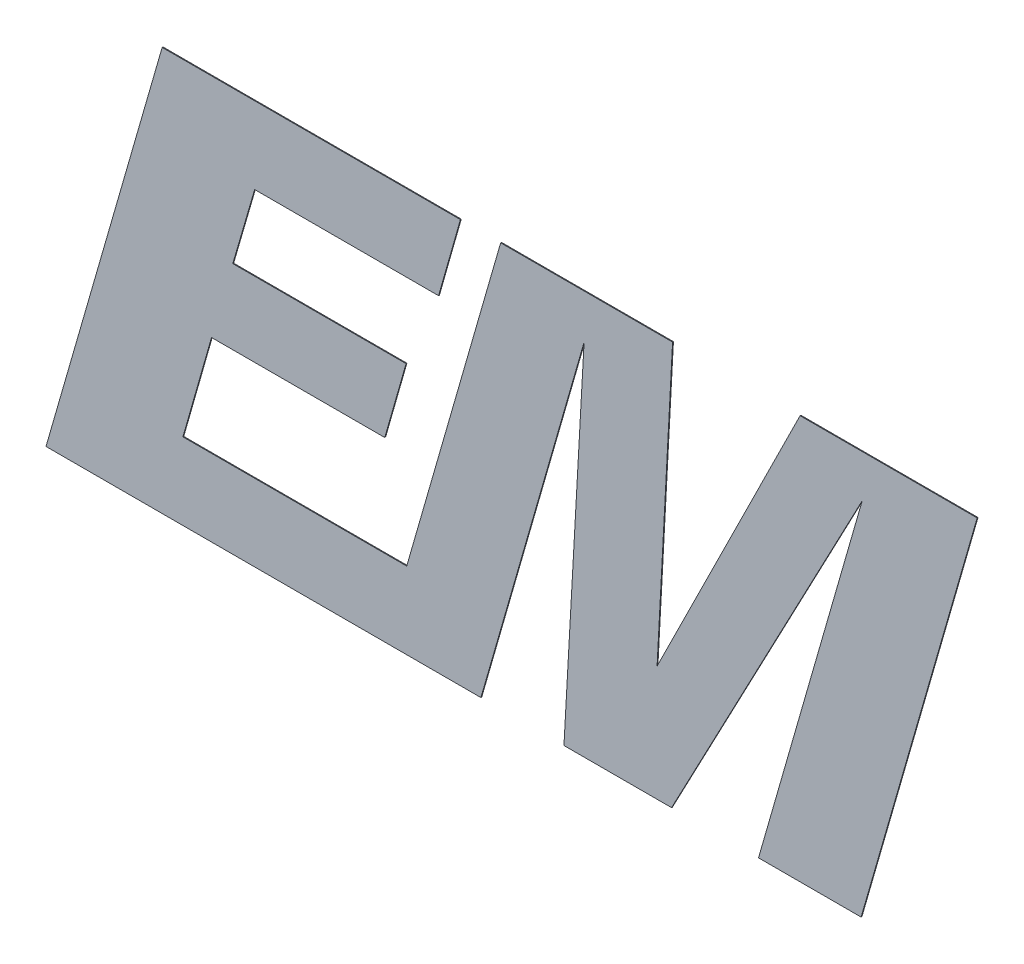
ISO-10303-21;
HEADER;
FILE_DESCRIPTION(('STEP AP214'),'2;1');
FILE_NAME('part.step','',(''),(''),'','','');
FILE_SCHEMA(('AUTOMOTIVE_DESIGN { 1 0 10303 214 1 1 1 1 }'));
ENDSEC;
DATA;
#1=APPLICATION_CONTEXT('core data for automotive mechanical design processes');
#2=APPLICATION_PROTOCOL_DEFINITION('international standard','automotive_design',2000,#1);
#3=PRODUCT_CONTEXT('',#1,'mechanical');
#4=PRODUCT('Part','Part','',(#3));
#5=PRODUCT_RELATED_PRODUCT_CATEGORY('part','',(#4));
#6=PRODUCT_DEFINITION_FORMATION('','',#4);
#7=PRODUCT_DEFINITION_CONTEXT('part definition',#1,'design');
#8=PRODUCT_DEFINITION('design','',#6,#7);
#9=PRODUCT_DEFINITION_SHAPE('','',#8);
#10=(LENGTH_UNIT() NAMED_UNIT(*) SI_UNIT(.MILLI.,.METRE.));
#11=(NAMED_UNIT(*) PLANE_ANGLE_UNIT() SI_UNIT($,.RADIAN.));
#12=(NAMED_UNIT(*) SI_UNIT($,.STERADIAN.) SOLID_ANGLE_UNIT());
#13=UNCERTAINTY_MEASURE_WITH_UNIT(LENGTH_MEASURE(1.E-05),#10,'distance_accuracy_value','');
#14=(GEOMETRIC_REPRESENTATION_CONTEXT(3) GLOBAL_UNCERTAINTY_ASSIGNED_CONTEXT((#13)) GLOBAL_UNIT_ASSIGNED_CONTEXT((#10,
#11,#12)) REPRESENTATION_CONTEXT('',''));
#15=CARTESIAN_POINT('',(0.,0.,0.));
#16=DIRECTION('',(0.,0.,1.));
#17=DIRECTION('',(1.,0.,0.));
#18=AXIS2_PLACEMENT_3D('',#15,#16,#17);
#19=CARTESIAN_POINT('',(10.9983805906603,6.94238146101223,5.505));
#20=DIRECTION('',(0.,-1.,0.));
#21=DIRECTION('',(0.,0.,-1.));
#22=AXIS2_PLACEMENT_3D('',#19,#20,#21);
#23=PLANE('',#22);
#24=DIRECTION('',(-1.,0.,0.));
#25=VECTOR('',#24,1.);
#26=CARTESIAN_POINT('',(10.9983805906603,6.94238146101223,5.5));
#27=LINE('',#26,#25);
#28=CARTESIAN_POINT('',(10.9983805906603,6.94238146101223,5.5));
#29=VERTEX_POINT('',#28);
#30=CARTESIAN_POINT('',(9.93725633674293,6.94238146101223,5.5));
#31=VERTEX_POINT('',#30);
#32=EDGE_CURVE('E10',#29,#31,#27,.T.);
#33=ORIENTED_EDGE('',*,*,#32,.T.);
#34=DIRECTION('',(0.,0.,-1.));
#35=VECTOR('',#34,1.);
#36=CARTESIAN_POINT('',(9.93725633674293,6.94238146101223,5.505));
#37=LINE('',#36,#35);
#38=CARTESIAN_POINT('',(9.93725633674293,6.94238146101223,5.505));
#39=VERTEX_POINT('',#38);
#40=EDGE_CURVE('E42',#39,#31,#37,.T.);
#41=ORIENTED_EDGE('',*,*,#40,.F.);
#42=DIRECTION('',(-1.,0.,0.));
#43=VECTOR('',#42,1.);
#44=CARTESIAN_POINT('',(10.9983805906603,6.94238146101223,5.505));
#45=LINE('',#44,#43);
#46=CARTESIAN_POINT('',(10.9983805906603,6.94238146101223,5.505));
#47=VERTEX_POINT('',#46);
#48=EDGE_CURVE('E258',#47,#39,#45,.T.);
#49=ORIENTED_EDGE('',*,*,#48,.F.);
#50=DIRECTION('',(0.,0.,-1.));
#51=VECTOR('',#50,1.);
#52=CARTESIAN_POINT('',(10.9983805906603,6.94238146101223,5.505));
#53=LINE('',#52,#51);
#54=EDGE_CURVE('E27',#47,#29,#53,.T.);
#55=ORIENTED_EDGE('',*,*,#54,.T.);
#56=EDGE_LOOP('',(#33,#41,#49,#55));
#57=FACE_BOUND('',#56,.T.);
#58=ADVANCED_FACE('F16',(#57),#23,.F.);
#59=CARTESIAN_POINT('',(9.93725633674293,6.94238146101223,5.505));
#60=DIRECTION('',(0.895867636182703,-0.444321030832906,0.));
#61=DIRECTION('',(0.,0.,-1.));
#62=AXIS2_PLACEMENT_3D('',#59,#60,#61);
#63=PLANE('',#62);
#64=DIRECTION('',(-0.444321030832906,-0.895867636182703,0.));
#65=VECTOR('',#64,1.);
#66=CARTESIAN_POINT('',(9.93725633674293,6.94238146101223,5.5));
#67=LINE('',#66,#65);
#68=CARTESIAN_POINT('',(9.08000804709148,5.21394426002698,5.5));
#69=VERTEX_POINT('',#68);
#70=EDGE_CURVE('E359',#31,#69,#67,.T.);
#71=ORIENTED_EDGE('',*,*,#70,.T.);
#72=DIRECTION('',(0.,0.,-1.));
#73=VECTOR('',#72,1.);
#74=CARTESIAN_POINT('',(9.08000804709148,5.21394426002698,5.505));
#75=LINE('',#74,#73);
#76=CARTESIAN_POINT('',(9.08000804709148,5.21394426002698,5.505));
#77=VERTEX_POINT('',#76);
#78=EDGE_CURVE('E256',#77,#69,#75,.T.);
#79=ORIENTED_EDGE('',*,*,#78,.F.);
#80=DIRECTION('',(-0.444321030832906,-0.895867636182703,0.));
#81=VECTOR('',#80,1.);
#82=CARTESIAN_POINT('',(9.93725633674293,6.94238146101223,5.505));
#83=LINE('',#82,#81);
#84=EDGE_CURVE('E224',#39,#77,#83,.T.);
#85=ORIENTED_EDGE('',*,*,#84,.F.);
#86=ORIENTED_EDGE('',*,*,#40,.T.);
#87=EDGE_LOOP('',(#71,#79,#85,#86));
#88=FACE_BOUND('',#87,.T.);
#89=ADVANCED_FACE('F462',(#88),#63,.F.);
#90=CARTESIAN_POINT('',(9.08000804709148,5.21394426002698,5.505));
#91=DIRECTION('',(-0.998554284376095,0.0537525920690827,0.));
#92=DIRECTION('',(0.,0.,1.));
#93=AXIS2_PLACEMENT_3D('',#90,#91,#92);
#94=PLANE('',#93);
#95=DIRECTION('',(0.0537525920690827,0.998554284376095,0.));
#96=VECTOR('',#95,1.);
#97=CARTESIAN_POINT('',(9.08000804709148,5.21394426002698,5.5));
#98=LINE('',#97,#96);
#99=CARTESIAN_POINT('',(9.17305053985855,6.94238146101223,5.5));
#100=VERTEX_POINT('',#99);
#101=EDGE_CURVE('E360',#69,#100,#98,.T.);
#102=ORIENTED_EDGE('',*,*,#101,.T.);
#103=DIRECTION('',(0.,0.,-1.));
#104=VECTOR('',#103,1.);
#105=CARTESIAN_POINT('',(9.17305053985855,6.94238146101223,5.505));
#106=LINE('',#105,#104);
#107=CARTESIAN_POINT('',(9.17305053985855,6.94238146101223,5.505));
#108=VERTEX_POINT('',#107);
#109=EDGE_CURVE('E257',#108,#100,#106,.T.);
#110=ORIENTED_EDGE('',*,*,#109,.F.);
#111=DIRECTION('',(0.0537525920690827,0.998554284376095,0.));
#112=VECTOR('',#111,1.);
#113=CARTESIAN_POINT('',(9.08000804709148,5.21394426002698,5.505));
#114=LINE('',#113,#112);
#115=EDGE_CURVE('E271',#77,#108,#114,.T.);
#116=ORIENTED_EDGE('',*,*,#115,.F.);
#117=ORIENTED_EDGE('',*,*,#78,.T.);
#118=EDGE_LOOP('',(#102,#110,#116,#117));
#119=FACE_BOUND('',#118,.T.);
#120=ADVANCED_FACE('F466',(#119),#94,.F.);
#121=CARTESIAN_POINT('',(9.17305053985855,6.94238146101223,5.505));
#122=DIRECTION('',(0.,-1.,0.));
#123=DIRECTION('',(0.,0.,-1.));
#124=AXIS2_PLACEMENT_3D('',#121,#122,#123);
#125=PLANE('',#124);
#126=DIRECTION('',(-1.,0.,0.));
#127=VECTOR('',#126,1.);
#128=CARTESIAN_POINT('',(9.17305053985855,6.94238146101223,5.5));
#129=LINE('',#128,#127);
#130=CARTESIAN_POINT('',(8.1427215702564,6.94238146101223,5.5));
#131=VERTEX_POINT('',#130);
#132=EDGE_CURVE('E252',#100,#131,#129,.T.);
#133=ORIENTED_EDGE('',*,*,#132,.T.);
#134=DIRECTION('',(0.,0.,-1.));
#135=VECTOR('',#134,1.);
#136=CARTESIAN_POINT('',(8.1427215702564,6.94238146101223,5.505));
#137=LINE('',#136,#135);
#138=CARTESIAN_POINT('',(8.1427215702564,6.94238146101223,5.505));
#139=VERTEX_POINT('',#138);
#140=EDGE_CURVE('E273',#139,#131,#137,.T.);
#141=ORIENTED_EDGE('',*,*,#140,.F.);
#142=DIRECTION('',(-1.,0.,0.));
#143=VECTOR('',#142,1.);
#144=CARTESIAN_POINT('',(9.17305053985855,6.94238146101223,5.505));
#145=LINE('',#144,#143);
#146=EDGE_CURVE('E267',#108,#139,#145,.T.);
#147=ORIENTED_EDGE('',*,*,#146,.F.);
#148=ORIENTED_EDGE('',*,*,#109,.T.);
#149=EDGE_LOOP('',(#133,#141,#147,#148));
#150=FACE_BOUND('',#149,.T.);
#151=ADVANCED_FACE('F782',(#150),#125,.F.);
#152=CARTESIAN_POINT('',(8.1427215702564,6.94238146101223,5.505));
#153=DIRECTION('',(0.961085306551391,-0.276251757516616,0.));
#154=DIRECTION('',(0.,0.,-1.));
#155=AXIS2_PLACEMENT_3D('',#152,#153,#154);
#156=PLANE('',#155);
#157=DIRECTION('',(-0.276251757516616,-0.961085306551391,0.));
#158=VECTOR('',#157,1.);
#159=CARTESIAN_POINT('',(8.1427215702564,6.94238146101223,5.5));
#160=LINE('',#159,#158);
#161=CARTESIAN_POINT('',(7.57960527905799,4.98328879055944,5.5));
#162=VERTEX_POINT('',#161);
#163=EDGE_CURVE('E276',#131,#162,#160,.T.);
#164=ORIENTED_EDGE('',*,*,#163,.T.);
#165=DIRECTION('',(0.,0.,-1.));
#166=VECTOR('',#165,1.);
#167=CARTESIAN_POINT('',(7.57960527905799,4.98328879055944,5.505));
#168=LINE('',#167,#166);
#169=CARTESIAN_POINT('',(7.57960527905799,4.98328879055944,5.505));
#170=VERTEX_POINT('',#169);
#171=EDGE_CURVE('E322',#170,#162,#168,.T.);
#172=ORIENTED_EDGE('',*,*,#171,.F.);
#173=DIRECTION('',(-0.276251757516616,-0.961085306551391,0.));
#174=VECTOR('',#173,1.);
#175=CARTESIAN_POINT('',(8.1427215702564,6.94238146101223,5.505));
#176=LINE('',#175,#174);
#177=EDGE_CURVE('E272',#139,#170,#176,.T.);
#178=ORIENTED_EDGE('',*,*,#177,.F.);
#179=ORIENTED_EDGE('',*,*,#140,.T.);
#180=EDGE_LOOP('',(#164,#172,#178,#179));
#181=FACE_BOUND('',#180,.T.);
#182=ADVANCED_FACE('F778',(#181),#156,.F.);
#183=CARTESIAN_POINT('',(7.57960527905799,4.98328879055944,5.505));
#184=DIRECTION('',(0.,-1.,0.));
#185=DIRECTION('',(0.,0.,-1.));
#186=AXIS2_PLACEMENT_3D('',#183,#184,#185);
#187=PLANE('',#186);
#188=DIRECTION('',(-1.,0.,0.));
#189=VECTOR('',#188,1.);
#190=CARTESIAN_POINT('',(7.57960527905799,4.98328879055944,5.5));
#191=LINE('',#190,#189);
#192=CARTESIAN_POINT('',(6.23843394197357,4.98328879055944,5.5));
#193=VERTEX_POINT('',#192);
#194=EDGE_CURVE('E277',#162,#193,#191,.T.);
#195=ORIENTED_EDGE('',*,*,#194,.T.);
#196=DIRECTION('',(0.,0.,-1.));
#197=VECTOR('',#196,1.);
#198=CARTESIAN_POINT('',(6.23843394197357,4.98328879055944,5.505));
#199=LINE('',#198,#197);
#200=CARTESIAN_POINT('',(6.23843394197357,4.98328879055944,5.505));
#201=VERTEX_POINT('',#200);
#202=EDGE_CURVE('E323',#201,#193,#199,.T.);
#203=ORIENTED_EDGE('',*,*,#202,.F.);
#204=DIRECTION('',(-1.,0.,0.));
#205=VECTOR('',#204,1.);
#206=CARTESIAN_POINT('',(7.57960527905799,4.98328879055944,5.505));
#207=LINE('',#206,#205);
#208=EDGE_CURVE('E349',#170,#201,#207,.T.);
#209=ORIENTED_EDGE('',*,*,#208,.F.);
#210=ORIENTED_EDGE('',*,*,#171,.T.);
#211=EDGE_LOOP('',(#195,#203,#209,#210));
#212=FACE_BOUND('',#211,.T.);
#213=ADVANCED_FACE('F420',(#212),#187,.F.);
#214=CARTESIAN_POINT('',(6.23843394197357,4.98328879055944,5.505));
#215=DIRECTION('',(-0.96172348726206,0.274021776595407,0.));
#216=DIRECTION('',(0.,0.,1.));
#217=AXIS2_PLACEMENT_3D('',#214,#215,#216);
#218=PLANE('',#217);
#219=DIRECTION('',(0.274021776595406,0.96172348726206,0.));
#220=VECTOR('',#219,1.);
#221=CARTESIAN_POINT('',(6.23843394197357,4.98328879055944,5.5));
#222=LINE('',#221,#220);
#223=CARTESIAN_POINT('',(6.40976406715013,5.58459941449989,5.5));
#224=VERTEX_POINT('',#223);
#225=EDGE_CURVE('E318',#193,#224,#222,.T.);
#226=ORIENTED_EDGE('',*,*,#225,.T.);
#227=DIRECTION('',(0.,0.,-1.));
#228=VECTOR('',#227,1.);
#229=CARTESIAN_POINT('',(6.40976406715013,5.58459941449989,5.505));
#230=LINE('',#229,#228);
#231=CARTESIAN_POINT('',(6.40976406715013,5.58459941449989,5.505));
#232=VERTEX_POINT('',#231);
#233=EDGE_CURVE('E328',#232,#224,#230,.T.);
#234=ORIENTED_EDGE('',*,*,#233,.F.);
#235=DIRECTION('',(0.274021776595406,0.96172348726206,0.));
#236=VECTOR('',#235,1.);
#237=CARTESIAN_POINT('',(6.23843394197357,4.98328879055944,5.505));
#238=LINE('',#237,#236);
#239=EDGE_CURVE('E301',#201,#232,#238,.T.);
#240=ORIENTED_EDGE('',*,*,#239,.F.);
#241=ORIENTED_EDGE('',*,*,#202,.T.);
#242=EDGE_LOOP('',(#226,#234,#240,#241));
#243=FACE_BOUND('',#242,.T.);
#244=ADVANCED_FACE('F432',(#243),#218,.F.);
#245=CARTESIAN_POINT('',(6.40976406715013,5.58459941449989,5.505));
#246=DIRECTION('',(0.,1.,0.));
#247=DIRECTION('',(1.,0.,0.));
#248=AXIS2_PLACEMENT_3D('',#245,#246,#247);
#249=PLANE('',#248);
#250=DIRECTION('',(1.,0.,0.));
#251=VECTOR('',#250,1.);
#252=CARTESIAN_POINT('',(6.40976406715013,5.58459941449989,5.5));
#253=LINE('',#252,#251);
#254=CARTESIAN_POINT('',(7.4480437522873,5.58459941449989,5.5));
#255=VERTEX_POINT('',#254);
#256=EDGE_CURVE('E324',#224,#255,#253,.T.);
#257=ORIENTED_EDGE('',*,*,#256,.T.);
#258=DIRECTION('',(0.,0.,-1.));
#259=VECTOR('',#258,1.);
#260=CARTESIAN_POINT('',(7.4480437522873,5.58459941449989,5.505));
#261=LINE('',#260,#259);
#262=CARTESIAN_POINT('',(7.4480437522873,5.58459941449989,5.505));
#263=VERTEX_POINT('',#262);
#264=EDGE_CURVE('E335',#263,#255,#261,.T.);
#265=ORIENTED_EDGE('',*,*,#264,.F.);
#266=DIRECTION('',(1.,0.,0.));
#267=VECTOR('',#266,1.);
#268=CARTESIAN_POINT('',(6.40976406715013,5.58459941449989,5.505));
#269=LINE('',#268,#267);
#270=EDGE_CURVE('E298',#232,#263,#269,.T.);
#271=ORIENTED_EDGE('',*,*,#270,.F.);
#272=ORIENTED_EDGE('',*,*,#233,.T.);
#273=EDGE_LOOP('',(#257,#265,#271,#272));
#274=FACE_BOUND('',#273,.T.);
#275=ADVANCED_FACE('F738',(#274),#249,.F.);
#276=CARTESIAN_POINT('',(7.4480437522873,5.58459941449989,5.505));
#277=DIRECTION('',(-0.961545429433448,0.274645930491691,0.));
#278=DIRECTION('',(0.,0.,1.));
#279=AXIS2_PLACEMENT_3D('',#276,#277,#278);
#280=PLANE('',#279);
#281=DIRECTION('',(0.274645930491691,0.961545429433448,0.));
#282=VECTOR('',#281,1.);
#283=CARTESIAN_POINT('',(7.4480437522873,5.58459941449989,5.5));
#284=LINE('',#283,#282);
#285=CARTESIAN_POINT('',(7.57579467344722,6.0318600534153,5.5));
#286=VERTEX_POINT('',#285);
#287=EDGE_CURVE('E331',#255,#286,#284,.T.);
#288=ORIENTED_EDGE('',*,*,#287,.T.);
#289=DIRECTION('',(0.,0.,-1.));
#290=VECTOR('',#289,1.);
#291=CARTESIAN_POINT('',(7.57579467344722,6.0318600534153,5.505));
#292=LINE('',#291,#290);
#293=CARTESIAN_POINT('',(7.57579467344722,6.0318600534153,5.505));
#294=VERTEX_POINT('',#293);
#295=EDGE_CURVE('E340',#294,#286,#292,.T.);
#296=ORIENTED_EDGE('',*,*,#295,.F.);
#297=DIRECTION('',(0.274645930491691,0.961545429433448,0.));
#298=VECTOR('',#297,1.);
#299=CARTESIAN_POINT('',(7.4480437522873,5.58459941449989,5.505));
#300=LINE('',#299,#298);
#301=EDGE_CURVE('E302',#263,#294,#300,.T.);
#302=ORIENTED_EDGE('',*,*,#301,.F.);
#303=ORIENTED_EDGE('',*,*,#264,.T.);
#304=EDGE_LOOP('',(#288,#296,#302,#303));
#305=FACE_BOUND('',#304,.T.);
#306=ADVANCED_FACE('F521',(#305),#280,.F.);
#307=CARTESIAN_POINT('',(7.57579467344722,6.0318600534153,5.505));
#308=DIRECTION('',(0.,-1.,0.));
#309=DIRECTION('',(0.,0.,-1.));
#310=AXIS2_PLACEMENT_3D('',#307,#308,#309);
#311=PLANE('',#310);
#312=DIRECTION('',(-1.,0.,0.));
#313=VECTOR('',#312,1.);
#314=CARTESIAN_POINT('',(7.57579467344722,6.0318600534153,5.5));
#315=LINE('',#314,#313);
#316=CARTESIAN_POINT('',(6.53736786068012,6.0318600534153,5.5));
#317=VERTEX_POINT('',#316);
#318=EDGE_CURVE('E336',#286,#317,#315,.T.);
#319=ORIENTED_EDGE('',*,*,#318,.T.);
#320=DIRECTION('',(0.,0.,-1.));
#321=VECTOR('',#320,1.);
#322=CARTESIAN_POINT('',(6.53736786068012,6.0318600534153,5.505));
#323=LINE('',#322,#321);
#324=CARTESIAN_POINT('',(6.53736786068012,6.0318600534153,5.505));
#325=VERTEX_POINT('',#324);
#326=EDGE_CURVE('E243',#325,#317,#323,.T.);
#327=ORIENTED_EDGE('',*,*,#326,.F.);
#328=DIRECTION('',(-1.,0.,0.));
#329=VECTOR('',#328,1.);
#330=CARTESIAN_POINT('',(7.57579467344722,6.0318600534153,5.505));
#331=LINE('',#330,#329);
#332=EDGE_CURVE('E250',#294,#325,#331,.T.);
#333=ORIENTED_EDGE('',*,*,#332,.F.);
#334=ORIENTED_EDGE('',*,*,#295,.T.);
#335=EDGE_LOOP('',(#319,#327,#333,#334));
#336=FACE_BOUND('',#335,.T.);
#337=ADVANCED_FACE('F18',(#336),#311,.F.);
#338=CARTESIAN_POINT('',(6.53736786068012,6.0318600534153,5.505));
#339=DIRECTION('',(-0.96017631143276,0.279394794087829,0.));
#340=DIRECTION('',(0.,0.,1.));
#341=AXIS2_PLACEMENT_3D('',#338,#339,#340);
#342=PLANE('',#341);
#343=DIRECTION('',(0.279394794087829,0.96017631143276,0.));
#344=VECTOR('',#343,1.);
#345=CARTESIAN_POINT('',(6.53736786068012,6.0318600534153,5.5));
#346=LINE('',#345,#344);
#347=CARTESIAN_POINT('',(6.66831145141171,6.48186462263034,5.5));
#348=VERTEX_POINT('',#347);
#349=EDGE_CURVE('E246',#317,#348,#346,.T.);
#350=ORIENTED_EDGE('',*,*,#349,.T.);
#351=DIRECTION('',(0.,0.,-1.));
#352=VECTOR('',#351,1.);
#353=CARTESIAN_POINT('',(6.66831145141171,6.48186462263034,5.505));
#354=LINE('',#353,#352);
#355=CARTESIAN_POINT('',(6.66831145141171,6.48186462263034,5.505));
#356=VERTEX_POINT('',#355);
#357=EDGE_CURVE('E314',#356,#348,#354,.T.);
#358=ORIENTED_EDGE('',*,*,#357,.F.);
#359=DIRECTION('',(0.279394794087829,0.96017631143276,0.));
#360=VECTOR('',#359,1.);
#361=CARTESIAN_POINT('',(6.53736786068012,6.0318600534153,5.505));
#362=LINE('',#361,#360);
#363=EDGE_CURVE('E248',#325,#356,#362,.T.);
#364=ORIENTED_EDGE('',*,*,#363,.F.);
#365=ORIENTED_EDGE('',*,*,#326,.T.);
#366=EDGE_LOOP('',(#350,#358,#364,#365));
#367=FACE_BOUND('',#366,.T.);
#368=ADVANCED_FACE('F526',(#367),#342,.F.);
#369=CARTESIAN_POINT('',(6.66831145141171,6.48186462263034,5.505));
#370=DIRECTION('',(0.,1.,0.));
#371=DIRECTION('',(1.,0.,0.));
#372=AXIS2_PLACEMENT_3D('',#369,#370,#371);
#373=PLANE('',#372);
#374=DIRECTION('',(1.,0.,0.));
#375=VECTOR('',#374,1.);
#376=CARTESIAN_POINT('',(6.66831145141171,6.48186462263034,5.5));
#377=LINE('',#376,#375);
#378=CARTESIAN_POINT('',(7.77060636837577,6.48186462263034,5.5));
#379=VERTEX_POINT('',#378);
#380=EDGE_CURVE('E247',#348,#379,#377,.T.);
#381=ORIENTED_EDGE('',*,*,#380,.T.);
#382=DIRECTION('',(0.,0.,-1.));
#383=VECTOR('',#382,1.);
#384=CARTESIAN_POINT('',(7.77060636837577,6.48186462263034,5.505));
#385=LINE('',#384,#383);
#386=CARTESIAN_POINT('',(7.77060636837577,6.48186462263034,5.505));
#387=VERTEX_POINT('',#386);
#388=EDGE_CURVE('E278',#387,#379,#385,.T.);
#389=ORIENTED_EDGE('',*,*,#388,.F.);
#390=DIRECTION('',(1.,0.,0.));
#391=VECTOR('',#390,1.);
#392=CARTESIAN_POINT('',(6.66831145141171,6.48186462263034,5.505));
#393=LINE('',#392,#391);
#394=EDGE_CURVE('E242',#356,#387,#393,.T.);
#395=ORIENTED_EDGE('',*,*,#394,.F.);
#396=ORIENTED_EDGE('',*,*,#357,.T.);
#397=EDGE_LOOP('',(#381,#389,#395,#396));
#398=FACE_BOUND('',#397,.T.);
#399=ADVANCED_FACE('F496',(#398),#373,.F.);
#400=CARTESIAN_POINT('',(7.77060636837577,6.48186462263034,5.505));
#401=DIRECTION('',(-0.961953028041559,0.273214882174592,0.));
#402=DIRECTION('',(0.,0.,1.));
#403=AXIS2_PLACEMENT_3D('',#400,#401,#402);
#404=PLANE('',#403);
#405=DIRECTION('',(0.273214882174592,0.961953028041559,0.));
#406=VECTOR('',#405,1.);
#407=CARTESIAN_POINT('',(7.77060636837577,6.48186462263034,5.5));
#408=LINE('',#407,#406);
#409=CARTESIAN_POINT('',(7.90140283147759,6.94238146101223,5.5));
#410=VERTEX_POINT('',#409);
#411=EDGE_CURVE('E282',#379,#410,#408,.T.);
#412=ORIENTED_EDGE('',*,*,#411,.T.);
#413=DIRECTION('',(0.,0.,-1.));
#414=VECTOR('',#413,1.);
#415=CARTESIAN_POINT('',(7.90140283147759,6.94238146101223,5.505));
#416=LINE('',#415,#414);
#417=CARTESIAN_POINT('',(7.90140283147759,6.94238146101223,5.505));
#418=VERTEX_POINT('',#417);
#419=EDGE_CURVE('E294',#418,#410,#416,.T.);
#420=ORIENTED_EDGE('',*,*,#419,.F.);
#421=DIRECTION('',(0.273214882174592,0.961953028041559,0.));
#422=VECTOR('',#421,1.);
#423=CARTESIAN_POINT('',(7.77060636837577,6.48186462263034,5.505));
#424=LINE('',#423,#422);
#425=EDGE_CURVE('E239',#387,#418,#424,.T.);
#426=ORIENTED_EDGE('',*,*,#425,.F.);
#427=ORIENTED_EDGE('',*,*,#388,.T.);
#428=EDGE_LOOP('',(#412,#420,#426,#427));
#429=FACE_BOUND('',#428,.T.);
#430=ADVANCED_FACE('F500',(#429),#404,.F.);
#431=CARTESIAN_POINT('',(7.90140283147759,6.94238146101223,5.505));
#432=DIRECTION('',(0.,-1.,0.));
#433=DIRECTION('',(0.,0.,-1.));
#434=AXIS2_PLACEMENT_3D('',#431,#432,#433);
#435=PLANE('',#434);
#436=DIRECTION('',(-1.,0.,0.));
#437=VECTOR('',#436,1.);
#438=CARTESIAN_POINT('',(7.90140283147759,6.94238146101223,5.5));
#439=LINE('',#438,#437);
#440=CARTESIAN_POINT('',(6.11404488717605,6.94238146101223,5.5));
#441=VERTEX_POINT('',#440);
#442=EDGE_CURVE('E283',#410,#441,#439,.T.);
#443=ORIENTED_EDGE('',*,*,#442,.T.);
#444=DIRECTION('',(0.,0.,-1.));
#445=VECTOR('',#444,1.);
#446=CARTESIAN_POINT('',(6.11404488717605,6.94238146101223,5.505));
#447=LINE('',#446,#445);
#448=CARTESIAN_POINT('',(6.11404488717605,6.94238146101223,5.505));
#449=VERTEX_POINT('',#448);
#450=EDGE_CURVE('E227',#449,#441,#447,.T.);
#451=ORIENTED_EDGE('',*,*,#450,.F.);
#452=DIRECTION('',(-1.,0.,0.));
#453=VECTOR('',#452,1.);
#454=CARTESIAN_POINT('',(7.90140283147759,6.94238146101223,5.505));
#455=LINE('',#454,#453);
#456=EDGE_CURVE('E192',#418,#449,#455,.T.);
#457=ORIENTED_EDGE('',*,*,#456,.F.);
#458=ORIENTED_EDGE('',*,*,#419,.T.);
#459=EDGE_LOOP('',(#443,#451,#457,#458));
#460=FACE_BOUND('',#459,.T.);
#461=ADVANCED_FACE('F503',(#460),#435,.F.);
#462=CARTESIAN_POINT('',(6.11404488717605,6.94238146101223,5.505));
#463=DIRECTION('',(0.961002990822128,-0.276537975024996,0.));
#464=DIRECTION('',(0.,0.,-1.));
#465=AXIS2_PLACEMENT_3D('',#462,#463,#464);
#466=PLANE('',#465);
#467=DIRECTION('',(-0.276537975024996,-0.961002990822128,0.));
#468=VECTOR('',#467,1.);
#469=CARTESIAN_POINT('',(6.11404488717605,6.94238146101223,5.5));
#470=LINE('',#469,#468);
#471=CARTESIAN_POINT('',(5.41784429630276,4.52299999999992,5.5));
#472=VERTEX_POINT('',#471);
#473=EDGE_CURVE('E201',#441,#472,#470,.T.);
#474=ORIENTED_EDGE('',*,*,#473,.T.);
#475=DIRECTION('',(0.,0.,-1.));
#476=VECTOR('',#475,1.);
#477=CARTESIAN_POINT('',(5.41784429630276,4.52299999999992,5.505));
#478=LINE('',#477,#476);
#479=CARTESIAN_POINT('',(5.41784429630276,4.52299999999992,5.505));
#480=VERTEX_POINT('',#479);
#481=EDGE_CURVE('E198',#480,#472,#478,.T.);
#482=ORIENTED_EDGE('',*,*,#481,.F.);
#483=DIRECTION('',(-0.276537975024996,-0.961002990822128,0.));
#484=VECTOR('',#483,1.);
#485=CARTESIAN_POINT('',(6.11404488717605,6.94238146101223,5.505));
#486=LINE('',#485,#484);
#487=EDGE_CURVE('E185',#449,#480,#486,.T.);
#488=ORIENTED_EDGE('',*,*,#487,.F.);
#489=ORIENTED_EDGE('',*,*,#450,.T.);
#490=EDGE_LOOP('',(#474,#482,#488,#489));
#491=FACE_BOUND('',#490,.T.);
#492=ADVANCED_FACE('F199',(#491),#466,.F.);
#493=CARTESIAN_POINT('',(7.59361918388929,4.52299999999992,5.505));
#494=DIRECTION('',(0.,1.,0.));
#495=DIRECTION('',(1.,0.,0.));
#496=AXIS2_PLACEMENT_3D('',#493,#494,#495);
#497=PLANE('',#496);
#498=DIRECTION('',(1.,0.,0.));
#499=VECTOR('',#498,1.);
#500=CARTESIAN_POINT('',(7.59361918388929,4.52299999999992,5.5));
#501=LINE('',#500,#499);
#502=CARTESIAN_POINT('',(8.02426175699352,4.52299999999993,5.5));
#503=VERTEX_POINT('',#502);
#504=EDGE_CURVE('E206',#472,#503,#501,.T.);
#505=ORIENTED_EDGE('',*,*,#504,.T.);
#506=DIRECTION('',(0.,0.,-1.));
#507=VECTOR('',#506,1.);
#508=CARTESIAN_POINT('',(8.02426175699352,4.52299999999993,5.505));
#509=LINE('',#508,#507);
#510=CARTESIAN_POINT('',(8.02426175699352,4.52299999999993,5.505));
#511=VERTEX_POINT('',#510);
#512=EDGE_CURVE('E210',#511,#503,#509,.T.);
#513=ORIENTED_EDGE('',*,*,#512,.F.);
#514=DIRECTION('',(1.,0.,0.));
#515=VECTOR('',#514,1.);
#516=CARTESIAN_POINT('',(5.41784429630276,4.52299999999992,5.505));
#517=LINE('',#516,#515);
#518=EDGE_CURVE('E189',#480,#511,#517,.T.);
#519=ORIENTED_EDGE('',*,*,#518,.F.);
#520=ORIENTED_EDGE('',*,*,#481,.T.);
#521=EDGE_LOOP('',(#505,#513,#519,#520));
#522=FACE_BOUND('',#521,.T.);
#523=ADVANCED_FACE('F209',(#522),#497,.F.);
#524=CARTESIAN_POINT('',(8.02426175699352,4.52299999999993,5.505));
#525=DIRECTION('',(-0.961163884540894,0.27597823655908,0.));
#526=DIRECTION('',(0.,0.,1.));
#527=AXIS2_PLACEMENT_3D('',#524,#525,#526);
#528=PLANE('',#527);
#529=DIRECTION('',(0.27597823655908,0.961163884540894,0.));
#530=VECTOR('',#529,1.);
#531=CARTESIAN_POINT('',(8.02426175699352,4.52299999999993,5.5));
#532=LINE('',#531,#530);
#533=CARTESIAN_POINT('',(8.64271274983446,6.67691172176686,5.5));
#534=VERTEX_POINT('',#533);
#535=EDGE_CURVE('E207',#503,#534,#532,.T.);
#536=ORIENTED_EDGE('',*,*,#535,.T.);
#537=DIRECTION('',(0.,0.,-1.));
#538=VECTOR('',#537,1.);
#539=CARTESIAN_POINT('',(8.64271274983446,6.67691172176686,5.505));
#540=LINE('',#539,#538);
#541=CARTESIAN_POINT('',(8.64271274983446,6.67691172176686,5.505));
#542=VERTEX_POINT('',#541);
#543=EDGE_CURVE('E232',#542,#534,#540,.T.);
#544=ORIENTED_EDGE('',*,*,#543,.F.);
#545=DIRECTION('',(0.27597823655908,0.961163884540894,0.));
#546=VECTOR('',#545,1.);
#547=CARTESIAN_POINT('',(8.02426175699352,4.52299999999993,5.505));
#548=LINE('',#547,#546);
#549=EDGE_CURVE('E213',#511,#542,#548,.T.);
#550=ORIENTED_EDGE('',*,*,#549,.F.);
#551=ORIENTED_EDGE('',*,*,#512,.T.);
#552=EDGE_LOOP('',(#536,#544,#550,#551));
#553=FACE_BOUND('',#552,.T.);
#554=ADVANCED_FACE('F532',(#553),#528,.F.);
#555=CARTESIAN_POINT('',(8.64271274983446,6.67691172176686,5.505));
#556=DIRECTION('',(0.998432730113025,-0.0559650197806821,0.));
#557=DIRECTION('',(0.,0.,-1.));
#558=AXIS2_PLACEMENT_3D('',#555,#556,#557);
#559=PLANE('',#558);
#560=DIRECTION('',(-0.0559650197806821,-0.998432730113025,0.));
#561=VECTOR('',#560,1.);
#562=CARTESIAN_POINT('',(8.64271274983446,6.67691172176686,5.5));
#563=LINE('',#562,#561);
#564=CARTESIAN_POINT('',(8.52197981662935,4.52299999999993,5.5));
#565=VERTEX_POINT('',#564);
#566=EDGE_CURVE('E228',#534,#565,#563,.T.);
#567=ORIENTED_EDGE('',*,*,#566,.T.);
#568=DIRECTION('',(0.,0.,-1.));
#569=VECTOR('',#568,1.);
#570=CARTESIAN_POINT('',(8.52197981662935,4.52299999999993,5.505));
#571=LINE('',#570,#569);
#572=CARTESIAN_POINT('',(8.52197981662935,4.52299999999993,5.505));
#573=VERTEX_POINT('',#572);
#574=EDGE_CURVE('E307',#573,#565,#571,.T.);
#575=ORIENTED_EDGE('',*,*,#574,.F.);
#576=DIRECTION('',(-0.0559650197806821,-0.998432730113025,0.));
#577=VECTOR('',#576,1.);
#578=CARTESIAN_POINT('',(8.64271274983446,6.67691172176686,5.505));
#579=LINE('',#578,#577);
#580=EDGE_CURVE('E220',#542,#573,#579,.T.);
#581=ORIENTED_EDGE('',*,*,#580,.F.);
#582=ORIENTED_EDGE('',*,*,#543,.T.);
#583=EDGE_LOOP('',(#567,#575,#581,#582));
#584=FACE_BOUND('',#583,.T.);
#585=ADVANCED_FACE('F538',(#584),#559,.F.);
#586=CARTESIAN_POINT('',(8.52197981662935,4.52299999999993,5.505));
#587=DIRECTION('',(0.,1.,0.));
#588=DIRECTION('',(1.,0.,0.));
#589=AXIS2_PLACEMENT_3D('',#586,#587,#588);
#590=PLANE('',#589);
#591=DIRECTION('',(1.,0.,0.));
#592=VECTOR('',#591,1.);
#593=CARTESIAN_POINT('',(8.52197981662935,4.52299999999993,5.5));
#594=LINE('',#593,#592);
#595=CARTESIAN_POINT('',(9.16696527754601,4.52299999999993,5.5));
#596=VERTEX_POINT('',#595);
#597=EDGE_CURVE('E303',#565,#596,#594,.T.);
#598=ORIENTED_EDGE('',*,*,#597,.T.);
#599=DIRECTION('',(0.,0.,-1.));
#600=VECTOR('',#599,1.);
#601=CARTESIAN_POINT('',(9.16696527754601,4.52299999999993,5.505));
#602=LINE('',#601,#600);
#603=CARTESIAN_POINT('',(9.16696527754601,4.52299999999993,5.505));
#604=VERTEX_POINT('',#603);
#605=EDGE_CURVE('E343',#604,#596,#602,.T.);
#606=ORIENTED_EDGE('',*,*,#605,.F.);
#607=DIRECTION('',(1.,0.,0.));
#608=VECTOR('',#607,1.);
#609=CARTESIAN_POINT('',(8.52197981662935,4.52299999999993,5.505));
#610=LINE('',#609,#608);
#611=EDGE_CURVE('E266',#573,#604,#610,.T.);
#612=ORIENTED_EDGE('',*,*,#611,.F.);
#613=ORIENTED_EDGE('',*,*,#574,.T.);
#614=EDGE_LOOP('',(#598,#606,#612,#613));
#615=FACE_BOUND('',#614,.T.);
#616=ADVANCED_FACE('F540',(#615),#590,.F.);
#617=CARTESIAN_POINT('',(9.16696527754601,4.52299999999993,5.505));
#618=DIRECTION('',(-0.884338666563761,0.466845930495521,0.));
#619=DIRECTION('',(0.,0.,1.));
#620=AXIS2_PLACEMENT_3D('',#617,#618,#619);
#621=PLANE('',#620);
#622=DIRECTION('',(0.466845930495521,0.884338666563761,0.));
#623=VECTOR('',#622,1.);
#624=CARTESIAN_POINT('',(9.16696527754601,4.52299999999993,5.5));
#625=LINE('',#624,#623);
#626=CARTESIAN_POINT('',(10.3094996013238,6.68728421967923,5.5));
#627=VERTEX_POINT('',#626);
#628=EDGE_CURVE('E369',#596,#627,#625,.T.);
#629=ORIENTED_EDGE('',*,*,#628,.T.);
#630=DIRECTION('',(0.,0.,-1.));
#631=VECTOR('',#630,1.);
#632=CARTESIAN_POINT('',(10.3094996013238,6.68728421967923,5.505));
#633=LINE('',#632,#631);
#634=CARTESIAN_POINT('',(10.3094996013238,6.68728421967923,5.505));
#635=VERTEX_POINT('',#634);
#636=EDGE_CURVE('E237',#635,#627,#633,.T.);
#637=ORIENTED_EDGE('',*,*,#636,.F.);
#638=DIRECTION('',(0.466845930495521,0.884338666563761,0.));
#639=VECTOR('',#638,1.);
#640=CARTESIAN_POINT('',(9.16696527754601,4.52299999999993,5.505));
#641=LINE('',#640,#639);
#642=EDGE_CURVE('E350',#604,#635,#641,.T.);
#643=ORIENTED_EDGE('',*,*,#642,.F.);
#644=ORIENTED_EDGE('',*,*,#605,.T.);
#645=EDGE_LOOP('',(#629,#637,#643,#644));
#646=FACE_BOUND('',#645,.T.);
#647=ADVANCED_FACE('F545',(#646),#621,.F.);
#648=CARTESIAN_POINT('',(10.3094996013238,6.68728421967923,5.505));
#649=DIRECTION('',(0.961154223343869,-0.276011881896856,0.));
#650=DIRECTION('',(0.,0.,-1.));
#651=AXIS2_PLACEMENT_3D('',#648,#649,#650);
#652=PLANE('',#651);
#653=DIRECTION('',(-0.276011881896856,-0.961154223343869,0.));
#654=VECTOR('',#653,1.);
#655=CARTESIAN_POINT('',(10.3094996013238,6.68728421967923,5.5));
#656=LINE('',#655,#654);
#657=CARTESIAN_POINT('',(9.68798835377902,4.52299999999993,5.5));
#658=VERTEX_POINT('',#657);
#659=EDGE_CURVE('E317',#627,#658,#656,.T.);
#660=ORIENTED_EDGE('',*,*,#659,.T.);
#661=DIRECTION('',(0.,0.,-1.));
#662=VECTOR('',#661,1.);
#663=CARTESIAN_POINT('',(9.68798835377902,4.52299999999993,5.505));
#664=LINE('',#663,#662);
#665=CARTESIAN_POINT('',(9.68798835377902,4.52299999999993,5.505));
#666=VERTEX_POINT('',#665);
#667=EDGE_CURVE('E238',#666,#658,#664,.T.);
#668=ORIENTED_EDGE('',*,*,#667,.F.);
#669=DIRECTION('',(-0.276011881896856,-0.961154223343869,0.));
#670=VECTOR('',#669,1.);
#671=CARTESIAN_POINT('',(10.3094996013238,6.68728421967923,5.505));
#672=LINE('',#671,#670);
#673=EDGE_CURVE('E290',#635,#666,#672,.T.);
#674=ORIENTED_EDGE('',*,*,#673,.F.);
#675=ORIENTED_EDGE('',*,*,#636,.T.);
#676=EDGE_LOOP('',(#660,#668,#674,#675));
#677=FACE_BOUND('',#676,.T.);
#678=ADVANCED_FACE('F836',(#677),#652,.F.);
#679=CARTESIAN_POINT('',(9.68798835377902,4.52299999999993,5.505));
#680=DIRECTION('',(0.,1.,0.));
#681=DIRECTION('',(1.,0.,0.));
#682=AXIS2_PLACEMENT_3D('',#679,#680,#681);
#683=PLANE('',#682);
#684=DIRECTION('',(1.,0.,0.));
#685=VECTOR('',#684,1.);
#686=CARTESIAN_POINT('',(9.68798835377902,4.52299999999993,5.5));
#687=LINE('',#686,#685);
#688=CARTESIAN_POINT('',(10.3027905813945,4.52299999999993,5.5));
#689=VERTEX_POINT('',#688);
#690=EDGE_CURVE('E233',#658,#689,#687,.T.);
#691=ORIENTED_EDGE('',*,*,#690,.T.);
#692=DIRECTION('',(0.,0.,-1.));
#693=VECTOR('',#692,1.);
#694=CARTESIAN_POINT('',(10.3027905813945,4.52299999999993,5.505));
#695=LINE('',#694,#693);
#696=CARTESIAN_POINT('',(10.3027905813945,4.52299999999993,5.505));
#697=VERTEX_POINT('',#696);
#698=EDGE_CURVE('E261',#697,#689,#695,.T.);
#699=ORIENTED_EDGE('',*,*,#698,.F.);
#700=DIRECTION('',(1.,0.,0.));
#701=VECTOR('',#700,1.);
#702=CARTESIAN_POINT('',(9.68798835377902,4.52299999999993,5.505));
#703=LINE('',#702,#701);
#704=EDGE_CURVE('E287',#666,#697,#703,.T.);
#705=ORIENTED_EDGE('',*,*,#704,.F.);
#706=ORIENTED_EDGE('',*,*,#667,.T.);
#707=EDGE_LOOP('',(#691,#699,#705,#706));
#708=FACE_BOUND('',#707,.T.);
#709=ADVANCED_FACE('F832',(#708),#683,.F.);
#710=CARTESIAN_POINT('',(10.3027905813945,4.52299999999993,5.505));
#711=DIRECTION('',(-0.961067422110707,0.276313970253912,0.));
#712=DIRECTION('',(0.,0.,1.));
#713=AXIS2_PLACEMENT_3D('',#710,#711,#712);
#714=PLANE('',#713);
#715=DIRECTION('',(0.276313970253912,0.961067422110707,0.));
#716=VECTOR('',#715,1.);
#717=CARTESIAN_POINT('',(10.3027905813945,4.52299999999993,5.5));
#718=LINE('',#717,#716);
#719=EDGE_CURVE('E286',#689,#29,#718,.T.);
#720=ORIENTED_EDGE('',*,*,#719,.T.);
#721=ORIENTED_EDGE('',*,*,#54,.F.);
#722=DIRECTION('',(0.276313970253912,0.961067422110707,0.));
#723=VECTOR('',#722,1.);
#724=CARTESIAN_POINT('',(10.3027905813945,4.52299999999993,5.505));
#725=LINE('',#724,#723);
#726=EDGE_CURVE('E20',#697,#47,#725,.T.);
#727=ORIENTED_EDGE('',*,*,#726,.F.);
#728=ORIENTED_EDGE('',*,*,#698,.T.);
#729=EDGE_LOOP('',(#720,#721,#727,#728));
#730=FACE_BOUND('',#729,.T.);
#731=ADVANCED_FACE('F820',(#730),#714,.F.);
#732=CARTESIAN_POINT('',(0.0817044061757538,-8.90197282742609,5.505));
#733=DIRECTION('',(0.,0.,-1.));
#734=DIRECTION('',(0.,-1.,0.));
#735=AXIS2_PLACEMENT_3D('',#732,#733,#734);
#736=PLANE('',#735);
#737=ORIENTED_EDGE('',*,*,#48,.T.);
#738=ORIENTED_EDGE('',*,*,#84,.T.);
#739=ORIENTED_EDGE('',*,*,#115,.T.);
#740=ORIENTED_EDGE('',*,*,#146,.T.);
#741=ORIENTED_EDGE('',*,*,#177,.T.);
#742=ORIENTED_EDGE('',*,*,#208,.T.);
#743=ORIENTED_EDGE('',*,*,#239,.T.);
#744=ORIENTED_EDGE('',*,*,#270,.T.);
#745=ORIENTED_EDGE('',*,*,#301,.T.);
#746=ORIENTED_EDGE('',*,*,#332,.T.);
#747=ORIENTED_EDGE('',*,*,#363,.T.);
#748=ORIENTED_EDGE('',*,*,#394,.T.);
#749=ORIENTED_EDGE('',*,*,#425,.T.);
#750=ORIENTED_EDGE('',*,*,#456,.T.);
#751=ORIENTED_EDGE('',*,*,#487,.T.);
#752=ORIENTED_EDGE('',*,*,#518,.T.);
#753=ORIENTED_EDGE('',*,*,#549,.T.);
#754=ORIENTED_EDGE('',*,*,#580,.T.);
#755=ORIENTED_EDGE('',*,*,#611,.T.);
#756=ORIENTED_EDGE('',*,*,#642,.T.);
#757=ORIENTED_EDGE('',*,*,#673,.T.);
#758=ORIENTED_EDGE('',*,*,#704,.T.);
#759=ORIENTED_EDGE('',*,*,#726,.T.);
#760=EDGE_LOOP('',(#737,#738,#739,#740,#741,#742,#743,#744,#745,#746,#747,#748,#749,#750,#751,
#752,#753,#754,#755,#756,#757,#758,#759));
#761=FACE_BOUND('',#760,.T.);
#762=ADVANCED_FACE('F187',(#761),#736,.F.);
#763=CARTESIAN_POINT('',(0.0817044061757538,-8.90197282742609,5.5));
#764=DIRECTION('',(0.,0.,-1.));
#765=DIRECTION('',(0.,-1.,0.));
#766=AXIS2_PLACEMENT_3D('',#763,#764,#765);
#767=PLANE('',#766);
#768=ORIENTED_EDGE('',*,*,#32,.F.);
#769=ORIENTED_EDGE('',*,*,#719,.F.);
#770=ORIENTED_EDGE('',*,*,#690,.F.);
#771=ORIENTED_EDGE('',*,*,#659,.F.);
#772=ORIENTED_EDGE('',*,*,#628,.F.);
#773=ORIENTED_EDGE('',*,*,#597,.F.);
#774=ORIENTED_EDGE('',*,*,#566,.F.);
#775=ORIENTED_EDGE('',*,*,#535,.F.);
#776=ORIENTED_EDGE('',*,*,#504,.F.);
#777=ORIENTED_EDGE('',*,*,#473,.F.);
#778=ORIENTED_EDGE('',*,*,#442,.F.);
#779=ORIENTED_EDGE('',*,*,#411,.F.);
#780=ORIENTED_EDGE('',*,*,#380,.F.);
#781=ORIENTED_EDGE('',*,*,#349,.F.);
#782=ORIENTED_EDGE('',*,*,#318,.F.);
#783=ORIENTED_EDGE('',*,*,#287,.F.);
#784=ORIENTED_EDGE('',*,*,#256,.F.);
#785=ORIENTED_EDGE('',*,*,#225,.F.);
#786=ORIENTED_EDGE('',*,*,#194,.F.);
#787=ORIENTED_EDGE('',*,*,#163,.F.);
#788=ORIENTED_EDGE('',*,*,#132,.F.);
#789=ORIENTED_EDGE('',*,*,#101,.F.);
#790=ORIENTED_EDGE('',*,*,#70,.F.);
#791=EDGE_LOOP('',(#768,#769,#770,#771,#772,#773,#774,#775,#776,#777,#778,#779,#780,#781,#782,
#783,#784,#785,#786,#787,#788,#789,#790));
#792=FACE_BOUND('',#791,.T.);
#793=ADVANCED_FACE('F428',(#792),#767,.T.);
#794=CLOSED_SHELL('',(#58,#89,#120,#151,#182,#213,#244,#275,#306,#337,#368,#399,#430,#461,#492,
#523,#554,#585,#616,#647,#678,#709,#731,#762,#793));
#795=MANIFOLD_SOLID_BREP('B1',#794);
#796=ADVANCED_BREP_SHAPE_REPRESENTATION('',(#18,#795),#14);
#797=SHAPE_DEFINITION_REPRESENTATION(#9,#796);
ENDSEC;
END-ISO-10303-21;
